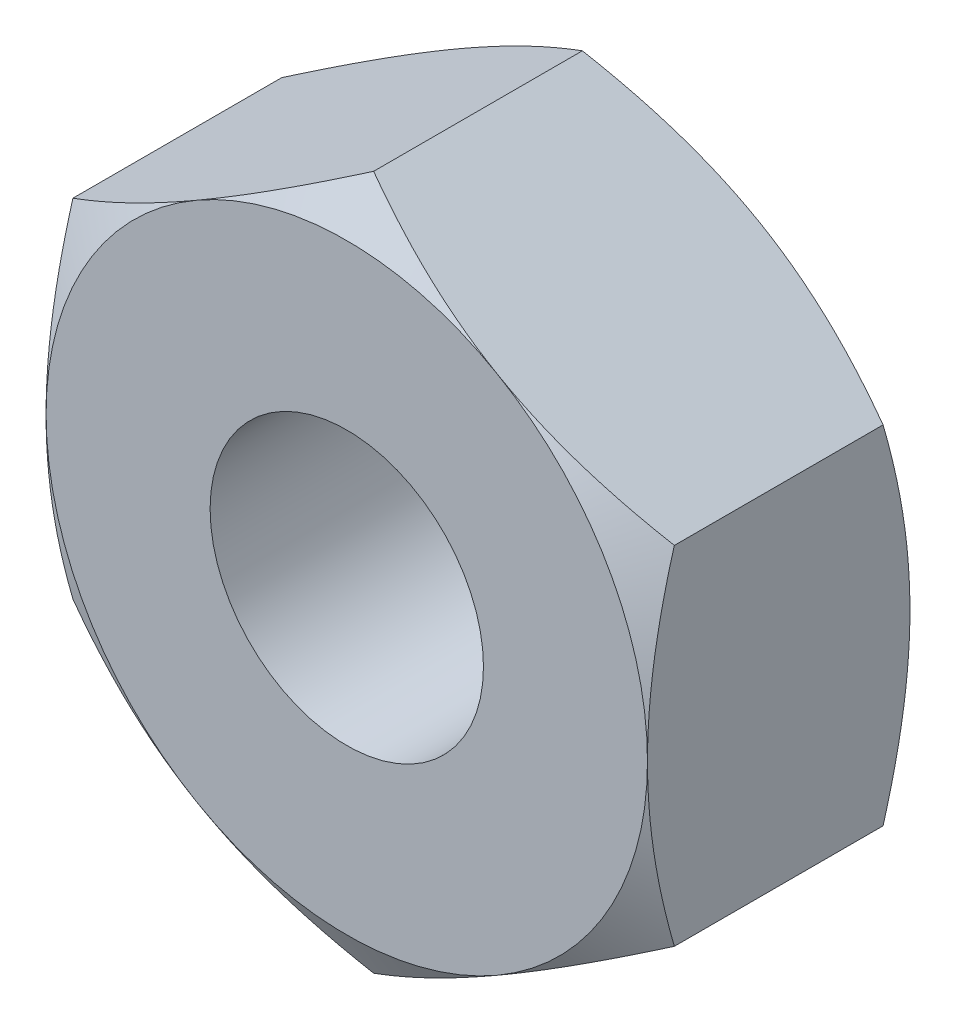
ISO-10303-21;
HEADER;
FILE_DESCRIPTION(('STEP AP214'),'2;1');
FILE_NAME('part.step','',(''),(''),'','','');
FILE_SCHEMA(('AUTOMOTIVE_DESIGN { 1 0 10303 214 1 1 1 1 }'));
ENDSEC;
DATA;
#1=APPLICATION_CONTEXT('core data for automotive mechanical design processes');
#2=APPLICATION_PROTOCOL_DEFINITION('international standard','automotive_design',2000,#1);
#3=PRODUCT_CONTEXT('',#1,'mechanical');
#4=PRODUCT('Part','Part','',(#3));
#5=PRODUCT_RELATED_PRODUCT_CATEGORY('part','',(#4));
#6=PRODUCT_DEFINITION_FORMATION('','',#4);
#7=PRODUCT_DEFINITION_CONTEXT('part definition',#1,'design');
#8=PRODUCT_DEFINITION('design','',#6,#7);
#9=PRODUCT_DEFINITION_SHAPE('','',#8);
#10=(LENGTH_UNIT() NAMED_UNIT(*) SI_UNIT(.MILLI.,.METRE.));
#11=(NAMED_UNIT(*) PLANE_ANGLE_UNIT() SI_UNIT($,.RADIAN.));
#12=(NAMED_UNIT(*) SI_UNIT($,.STERADIAN.) SOLID_ANGLE_UNIT());
#13=UNCERTAINTY_MEASURE_WITH_UNIT(LENGTH_MEASURE(1.E-05),#10,'distance_accuracy_value','');
#14=(GEOMETRIC_REPRESENTATION_CONTEXT(3) GLOBAL_UNCERTAINTY_ASSIGNED_CONTEXT((#13)) GLOBAL_UNIT_ASSIGNED_CONTEXT((#10,
#11,#12)) REPRESENTATION_CONTEXT('',''));
#15=CARTESIAN_POINT('',(0.,0.,0.));
#16=DIRECTION('',(0.,0.,1.));
#17=DIRECTION('',(1.,0.,0.));
#18=AXIS2_PLACEMENT_3D('',#15,#16,#17);
#19=CARTESIAN_POINT('',(0.,3.17542648054294,1.2));
#20=DIRECTION('',(0.5,-0.866025403784439,0.));
#21=DIRECTION('',(0.866025403784439,0.5,0.));
#22=AXIS2_PLACEMENT_3D('',#19,#20,#21);
#23=PLANE('',#22);
#24=CARTESIAN_POINT('',(0.000200000000000115,3.17554195059678,0.954313236635245));
#25=CARTESIAN_POINT('',(-0.120649220659906,3.10576962051743,0.994612337750741));
#26=CARTESIAN_POINT('',(-0.242541602622633,3.03539502097908,1.03126309740234));
#27=CARTESIAN_POINT('',(-0.488437126727892,2.89342717394439,1.0952378170302));
#28=CARTESIAN_POINT('',(-0.612444638573855,2.82183140359858,1.12253914432551));
#29=CARTESIAN_POINT('',(-0.858922797975943,2.67952717191842,1.16503825470589));
#30=CARTESIAN_POINT('',(-0.981355518587416,2.60884060771577,1.18051888137754));
#31=CARTESIAN_POINT('',(-1.22679714236891,2.46713482015519,1.19900060263006));
#32=CARTESIAN_POINT('',(-1.34980515323291,2.39611611197038,1.2020170005374));
#33=CARTESIAN_POINT('',(-1.57965878661079,2.26341005486544,1.19574685457145));
#34=CARTESIAN_POINT('',(-1.68653879125402,2.20170285541369,1.1879998457233));
#35=CARTESIAN_POINT('',(-1.89960246733475,2.07869048467395,1.16344481893565));
#36=CARTESIAN_POINT('',(-2.00578540164889,2.01738573896433,1.14662841034943));
#37=CARTESIAN_POINT('',(-2.21928848939318,1.89411967378235,1.10458807765405));
#38=CARTESIAN_POINT('',(-2.32658161614286,1.83217395817123,1.07918591931277));
#39=CARTESIAN_POINT('',(-2.53956747928405,1.70920651275308,1.02153277416002));
#40=CARTESIAN_POINT('',(-2.64526294502665,1.64818320715446,0.98929533670102));
#41=CARTESIAN_POINT('',(-2.7502,1.58759777021763,0.954313236635243));
#42=B_SPLINE_CURVE_WITH_KNOTS('',3,(#24,#25,#26,#27,#28,#29,#30,#31,#32,#33,#34,#35,#36,#37,#38,
#39,#40,#41),.UNSPECIFIED.,.F.,.F.,(4,2,2,2,2,2,2,2,4),(0.,0.435912828725888,0.872873557116331,
1.29901931904671,1.72464171213573,2.09526089052937,2.46622354066374,2.84541551798557,
3.22386274754524),.UNSPECIFIED.);
#43=CARTESIAN_POINT('',(0.,3.17542648054294,0.954379906938143));
#44=VERTEX_POINT('',#43);
#45=CARTESIAN_POINT('',(-1.375,2.38156986040721,1.2));
#46=VERTEX_POINT('',#45);
#47=EDGE_CURVE('E128',#44,#46,#42,.T.);
#48=ORIENTED_EDGE('',*,*,#47,.F.);
#49=DIRECTION('',(0.,0.,-1.));
#50=VECTOR('',#49,1.);
#51=CARTESIAN_POINT('',(0.,3.17542648054294,1.2));
#52=LINE('',#51,#50);
#53=CARTESIAN_POINT('',(0.,3.17542648054294,-0.954379906938143));
#54=VERTEX_POINT('',#53);
#55=EDGE_CURVE('E244',#44,#54,#52,.T.);
#56=ORIENTED_EDGE('',*,*,#55,.T.);
#57=CARTESIAN_POINT('',(-2.7502,1.58759777021763,-0.954313236635243));
#58=CARTESIAN_POINT('',(-2.6293507793401,1.65737010029699,-0.99461233775074));
#59=CARTESIAN_POINT('',(-2.50745839737737,1.72774469983533,-1.03126309740234));
#60=CARTESIAN_POINT('',(-2.26156287327211,1.86971254687003,-1.0952378170302));
#61=CARTESIAN_POINT('',(-2.13755536142615,1.94130831721583,-1.1225391443255));
#62=CARTESIAN_POINT('',(-1.89107720202406,2.08361254889599,-1.16503825470588));
#63=CARTESIAN_POINT('',(-1.76864448141259,2.15429911309864,-1.18051888137754));
#64=CARTESIAN_POINT('',(-1.52320285763109,2.29600490065923,-1.19900060263006));
#65=CARTESIAN_POINT('',(-1.40019484676709,2.36702360884404,-1.2020170005374));
#66=CARTESIAN_POINT('',(-1.17034121338921,2.49972966594897,-1.19574685457146));
#67=CARTESIAN_POINT('',(-1.06346120874598,2.56143686540072,-1.1879998457233));
#68=CARTESIAN_POINT('',(-0.850397532665252,2.68444923614046,-1.16344481893565));
#69=CARTESIAN_POINT('',(-0.744214598351113,2.74575398185008,-1.14662841034943));
#70=CARTESIAN_POINT('',(-0.530711510606817,2.86902004703206,-1.10458807765405));
#71=CARTESIAN_POINT('',(-0.423418383857146,2.93096576264318,-1.07918591931277));
#72=CARTESIAN_POINT('',(-0.210432520715949,3.05393320806134,-1.02153277416002));
#73=CARTESIAN_POINT('',(-0.104737054973348,3.11495651365995,-0.989295336701022));
#74=CARTESIAN_POINT('',(0.000199999999999903,3.17554195059678,-0.954313236635244));
#75=B_SPLINE_CURVE_WITH_KNOTS('',3,(#57,#58,#59,#60,#61,#62,#63,#64,#65,#66,#67,#68,#69,#70,#71,
#72,#73,#74),.UNSPECIFIED.,.F.,.F.,(4,2,2,2,2,2,2,2,4),(0.,0.435912828725888,0.872873557116332,
1.29901931904671,1.72464171213573,2.09526089052937,2.46622354066374,2.84541551798557,
3.22386274754524),.UNSPECIFIED.);
#76=CARTESIAN_POINT('',(-1.375,2.38156986040721,-1.2));
#77=VERTEX_POINT('',#76);
#78=EDGE_CURVE('E293',#77,#54,#75,.T.);
#79=ORIENTED_EDGE('',*,*,#78,.F.);
#80=CARTESIAN_POINT('',(-2.75,1.58771324027147,-0.954379906938141));
#81=VERTEX_POINT('',#80);
#82=EDGE_CURVE('E301',#81,#77,#75,.T.);
#83=ORIENTED_EDGE('',*,*,#82,.F.);
#84=DIRECTION('',(0.,0.,-1.));
#85=VECTOR('',#84,1.);
#86=CARTESIAN_POINT('',(-2.75,1.58771324027147,1.2));
#87=LINE('',#86,#85);
#88=CARTESIAN_POINT('',(-2.75,1.58771324027147,0.954379906938141));
#89=VERTEX_POINT('',#88);
#90=EDGE_CURVE('E153',#89,#81,#87,.T.);
#91=ORIENTED_EDGE('',*,*,#90,.F.);
#92=EDGE_CURVE('E138',#46,#89,#42,.T.);
#93=ORIENTED_EDGE('',*,*,#92,.F.);
#94=EDGE_LOOP('',(#48,#56,#79,#83,#91,#93));
#95=FACE_BOUND('',#94,.T.);
#96=ADVANCED_FACE('F39',(#95),#23,.F.);
#97=CARTESIAN_POINT('',(-2.75,1.58771324027147,1.2));
#98=DIRECTION('',(1.,0.,0.));
#99=DIRECTION('',(0.,0.,-1.));
#100=AXIS2_PLACEMENT_3D('',#97,#98,#99);
#101=PLANE('',#100);
#102=CARTESIAN_POINT('',(-2.75,-4.30390301720216,-0.161076408690825));
#103=CARTESIAN_POINT('',(-2.75,-4.1834618363452,-0.102495462412647));
#104=CARTESIAN_POINT('',(-2.75,-4.06274834693833,-0.0444649946514505));
#105=CARTESIAN_POINT('',(-2.75,-3.82063209362876,0.0701861633603225));
#106=CARTESIAN_POINT('',(-2.75,-3.69922922817271,0.12680663891875));
#107=CARTESIAN_POINT('',(-2.75,-3.45498258352454,0.238605553593622));
#108=CARTESIAN_POINT('',(-2.75,-3.33213458050114,0.293774796098197));
#109=CARTESIAN_POINT('',(-2.75,-3.08547511508713,0.401907353546489));
#110=CARTESIAN_POINT('',(-2.75,-2.96166369739842,0.454870770123445));
#111=CARTESIAN_POINT('',(-2.75,-2.70873002170823,0.559731360531962));
#112=CARTESIAN_POINT('',(-2.75,-2.57956837503774,0.611534033727797));
#113=CARTESIAN_POINT('',(-2.75,-2.31974843728982,0.711312632694167));
#114=CARTESIAN_POINT('',(-2.75,-2.18908998221549,0.759288134467299));
#115=CARTESIAN_POINT('',(-2.75,-1.92630078982468,0.850181497874806));
#116=CARTESIAN_POINT('',(-2.75,-1.79417351465793,0.893109270571249));
#117=CARTESIAN_POINT('',(-2.75,-1.52802381114183,0.972555534531204));
#118=CARTESIAN_POINT('',(-2.75,-1.39400198148737,1.00907600370373));
#119=CARTESIAN_POINT('',(-2.75,-1.12474260519898,1.07378343729291));
#120=CARTESIAN_POINT('',(-2.75,-0.989516518476871,1.10201722216619));
#121=CARTESIAN_POINT('',(-2.75,-0.717342133540319,1.14858513052452));
#122=CARTESIAN_POINT('',(-2.75,-0.580394010715088,1.16692025396292));
#123=CARTESIAN_POINT('',(-2.75,-0.307264223292279,1.19198982834035));
#124=CARTESIAN_POINT('',(-2.75,-0.171096876658462,1.19887642876326));
#125=CARTESIAN_POINT('',(-2.75,0.101336625312924,1.20086815686916));
#126=CARTESIAN_POINT('',(-2.75,0.237602781705802,1.19597315681278));
#127=CARTESIAN_POINT('',(-2.75,0.46779768056081,1.17810232782277));
#128=CARTESIAN_POINT('',(-2.75,0.56196791548098,1.16804522235862));
#129=CARTESIAN_POINT('',(-2.75,0.74964222683461,1.14290982744913));
#130=CARTESIAN_POINT('',(-2.75,0.843146215373602,1.12783088758259));
#131=CARTESIAN_POINT('',(-2.75,1.12250913895,1.07584910895221));
#132=CARTESIAN_POINT('',(-2.75,1.30711940645784,1.03221009052056));
#133=CARTESIAN_POINT('',(-2.75,1.67667658210247,0.930598702582575));
#134=CARTESIAN_POINT('',(-2.75,1.86153763251195,0.87232596653373));
#135=CARTESIAN_POINT('',(-2.75,2.13625516693807,0.777677043706168));
#136=CARTESIAN_POINT('',(-2.75,2.22739058019847,0.744924041754434));
#137=CARTESIAN_POINT('',(-2.75,2.4089035897785,0.677382180856421));
#138=CARTESIAN_POINT('',(-2.75,2.4992811965008,0.642593349909108));
#139=CARTESIAN_POINT('',(-2.75,2.71825345258541,0.555929422896265));
#140=CARTESIAN_POINT('',(-2.75,2.84649489461476,0.503164300130324));
#141=CARTESIAN_POINT('',(-2.75,3.10183054994608,0.394920499569379));
#142=CARTESIAN_POINT('',(-2.75,3.22892468521508,0.339441638824839));
#143=CARTESIAN_POINT('',(-2.75,3.60884508520039,0.169807317208292));
#144=CARTESIAN_POINT('',(-2.75,3.8602516138296,0.0524776136912291));
#145=CARTESIAN_POINT('',(-2.75,4.36073216273548,-0.187701259786182));
#146=CARTESIAN_POINT('',(-2.75,4.6098032281523,-0.310556513491418));
#147=CARTESIAN_POINT('',(-2.75,5.1061163633384,-0.559922515280692));
#148=CARTESIAN_POINT('',(-2.75,5.35335836018185,-0.68643340814069));
#149=CARTESIAN_POINT('',(-2.75,5.82470677893945,-0.930706625425081));
#150=CARTESIAN_POINT('',(-2.75,6.04892545541805,-1.04825313857292));
#151=CARTESIAN_POINT('',(-2.75,6.49653363605935,-1.28493475206167));
#152=CARTESIAN_POINT('',(-2.75,6.71992310596419,-1.40406991712259));
#153=CARTESIAN_POINT('',(-2.75,7.16544823954543,-1.64321658337446));
#154=CARTESIAN_POINT('',(-2.75,7.38758566096619,-1.76322481484966));
#155=CARTESIAN_POINT('',(-2.75,7.8313334660235,-2.00418017005897));
#156=CARTESIAN_POINT('',(-2.75,8.0529438808444,-2.12512723633799));
#157=CARTESIAN_POINT('',(-2.75,8.27436218409947,-2.2464225529458));
#158=B_SPLINE_CURVE_WITH_KNOTS('',3,(#102,#103,#104,#105,#106,#107,#108,#109,#110,#111,#112,
#113,#114,#115,#116,#117,#118,#119,#120,#121,#122,#123,#124,#125,#126,#127,#128,#129,#130,#131,
#132,#133,#134,#135,#136,#137,#138,#139,#140,#141,#142,#143,#144,#145,#146,#147,#148,#149,#150,
#151,#152,#153,#154,#155,#156,#157),.UNSPECIFIED.,.F.,.F.,(4,2,2,2,2,2,2,2,2,2,2,2,2,2,2,2,2,2,
2,2,2,2,2,2,2,2,2,4),(0.,0.401800999438941,0.803662809496805,1.20764727157332,1.61161309946234,
2.0290542035636,2.44654149029701,2.8631948591784,3.27971938165083,3.69384308413973,
4.10792494441568,4.51645837884842,4.92499624273406,5.20897756068266,5.49299567382171,
6.06133052851019,6.64245100592875,6.93295892589164,7.22346285140748,7.63943779361217,
8.05544081796505,8.8876337420945,9.72076650036479,10.553932298919,11.3134121306103,
12.0729229978169,12.8303656683844,13.5877623445884),.UNSPECIFIED.);
#159=CARTESIAN_POINT('',(-2.75,0.,1.2));
#160=VERTEX_POINT('',#159);
#161=EDGE_CURVE('E144',#89,#160,#158,.F.);
#162=ORIENTED_EDGE('',*,*,#161,.F.);
#163=ORIENTED_EDGE('',*,*,#90,.T.);
#164=CARTESIAN_POINT('',(-2.75,-4.30390301720192,0.161076408690709));
#165=CARTESIAN_POINT('',(-2.75,-4.18346183634496,0.102495462412532));
#166=CARTESIAN_POINT('',(-2.75,-4.0627483469381,0.0444649946513373));
#167=CARTESIAN_POINT('',(-2.75,-3.82063209362853,-0.0701861633604315));
#168=CARTESIAN_POINT('',(-2.75,-3.69922922817248,-0.126806638918857));
#169=CARTESIAN_POINT('',(-2.75,-3.45498258352431,-0.238605553593725));
#170=CARTESIAN_POINT('',(-2.75,-3.33213458050091,-0.293774796098297));
#171=CARTESIAN_POINT('',(-2.75,-3.08547511508691,-0.401907353546585));
#172=CARTESIAN_POINT('',(-2.75,-2.9616636973982,-0.454870770123538));
#173=CARTESIAN_POINT('',(-2.75,-2.70873002170802,-0.559731360532049));
#174=CARTESIAN_POINT('',(-2.75,-2.57956837503753,-0.611534033727881));
#175=CARTESIAN_POINT('',(-2.75,-2.31974843728962,-0.711312632694245));
#176=CARTESIAN_POINT('',(-2.75,-2.18908998221528,-0.759288134467373));
#177=CARTESIAN_POINT('',(-2.75,-1.92630078982448,-0.850181497874872));
#178=CARTESIAN_POINT('',(-2.75,-1.79417351465773,-0.893109270571312));
#179=CARTESIAN_POINT('',(-2.75,-1.52802381114163,-0.972555534531259));
#180=CARTESIAN_POINT('',(-2.75,-1.39400198148718,-1.00907600370378));
#181=CARTESIAN_POINT('',(-2.75,-1.1247426051988,-1.07378343729295));
#182=CARTESIAN_POINT('',(-2.75,-0.98951651847669,-1.10201722216622));
#183=CARTESIAN_POINT('',(-2.75,-0.717342133540144,-1.14858513052455));
#184=CARTESIAN_POINT('',(-2.75,-0.580394010714915,-1.16692025396294));
#185=CARTESIAN_POINT('',(-2.75,-0.307264223292112,-1.19198982834036));
#186=CARTESIAN_POINT('',(-2.75,-0.171096876658298,-1.19887642876326));
#187=CARTESIAN_POINT('',(-2.75,0.101336625313081,-1.20086815686916));
#188=CARTESIAN_POINT('',(-2.75,0.237602781705956,-1.19597315681277));
#189=CARTESIAN_POINT('',(-2.75,0.467797680560964,-1.17810232782276));
#190=CARTESIAN_POINT('',(-2.75,0.561967915481139,-1.1680452223586));
#191=CARTESIAN_POINT('',(-2.75,0.749642226834777,-1.14290982744911));
#192=CARTESIAN_POINT('',(-2.75,0.843146215373774,-1.12783088758256));
#193=CARTESIAN_POINT('',(-2.75,1.12250913895018,-1.07584910895217));
#194=CARTESIAN_POINT('',(-2.75,1.30711940645803,-1.03221009052051));
#195=CARTESIAN_POINT('',(-2.75,1.67667658210268,-0.930598702582513));
#196=CARTESIAN_POINT('',(-2.75,1.86153763251216,-0.87232596653366));
#197=CARTESIAN_POINT('',(-2.75,2.1362551669383,-0.777677043706087));
#198=CARTESIAN_POINT('',(-2.75,2.2273905801987,-0.74492404175435));
#199=CARTESIAN_POINT('',(-2.75,2.40890358977874,-0.677382180856329));
#200=CARTESIAN_POINT('',(-2.75,2.49928119650105,-0.642593349909013));
#201=CARTESIAN_POINT('',(-2.75,2.71825345258565,-0.555929422896168));
#202=CARTESIAN_POINT('',(-2.75,2.84649489461499,-0.503164300130228));
#203=CARTESIAN_POINT('',(-2.75,3.1018305499463,-0.394920499569286));
#204=CARTESIAN_POINT('',(-2.75,3.22892468521528,-0.33944163882475));
#205=CARTESIAN_POINT('',(-2.75,3.60884508520057,-0.16980731720821));
#206=CARTESIAN_POINT('',(-2.75,3.86025161382976,-0.0524776136911526));
#207=CARTESIAN_POINT('',(-2.75,4.36073216273561,0.187701259786246));
#208=CARTESIAN_POINT('',(-2.75,4.60980322815241,0.310556513491473));
#209=CARTESIAN_POINT('',(-2.75,5.10611636333848,0.559922515280733));
#210=CARTESIAN_POINT('',(-2.75,5.35335836018192,0.686433408140724));
#211=CARTESIAN_POINT('',(-2.75,5.82470677893949,0.930706625425102));
#212=CARTESIAN_POINT('',(-2.75,6.04892545541808,1.04825313857293));
#213=CARTESIAN_POINT('',(-2.75,6.49653363605935,1.28493475206167));
#214=CARTESIAN_POINT('',(-2.75,6.71992310596418,1.40406991712259));
#215=CARTESIAN_POINT('',(-2.75,7.1654482395454,1.64321658337444));
#216=CARTESIAN_POINT('',(-2.75,7.38758566096615,1.76322481484964));
#217=CARTESIAN_POINT('',(-2.75,7.83133346602344,2.00418017005894));
#218=CARTESIAN_POINT('',(-2.75,8.05294388084433,2.12512723633796));
#219=CARTESIAN_POINT('',(-2.75,8.27436218409939,2.24642255294576));
#220=B_SPLINE_CURVE_WITH_KNOTS('',3,(#164,#165,#166,#167,#168,#169,#170,#171,#172,#173,#174,
#175,#176,#177,#178,#179,#180,#181,#182,#183,#184,#185,#186,#187,#188,#189,#190,#191,#192,#193,
#194,#195,#196,#197,#198,#199,#200,#201,#202,#203,#204,#205,#206,#207,#208,#209,#210,#211,#212,
#213,#214,#215,#216,#217,#218,#219),.UNSPECIFIED.,.F.,.F.,(4,2,2,2,2,2,2,2,2,2,2,2,2,2,2,2,2,2,
2,2,2,2,2,2,2,2,2,4),(0.,0.401800999438933,0.803662809496789,1.2076472715733,1.61161309946231,
2.02905420356356,2.44654149029695,2.86319485917833,3.27971938165075,3.69384308413964,
4.10792494441558,4.51645837884831,4.92499624273394,5.20897756068255,5.49299567382162,
6.06133052851013,6.64245100592872,6.93295892589162,7.22346285140748,7.63943779361214,
8.055440817965,8.88763374209439,9.72076650036463,10.5539322989188,11.31341213061,
12.0729229978166,12.8303656683841,13.5877623445881),.UNSPECIFIED.);
#221=CARTESIAN_POINT('',(-2.75,0.,-1.2));
#222=VERTEX_POINT('',#221);
#223=EDGE_CURVE('E234',#222,#81,#220,.T.);
#224=ORIENTED_EDGE('',*,*,#223,.F.);
#225=CARTESIAN_POINT('',(-2.75,-1.58771324027169,-0.954379906938282));
#226=VERTEX_POINT('',#225);
#227=EDGE_CURVE('E316',#226,#222,#220,.T.);
#228=ORIENTED_EDGE('',*,*,#227,.F.);
#229=DIRECTION('',(0.,0.,-1.));
#230=VECTOR('',#229,1.);
#231=CARTESIAN_POINT('',(-2.75,-1.58771324027147,1.2));
#232=LINE('',#231,#230);
#233=CARTESIAN_POINT('',(-2.75,-1.58771324027147,0.95437990693814));
#234=VERTEX_POINT('',#233);
#235=EDGE_CURVE('E260',#234,#226,#232,.T.);
#236=ORIENTED_EDGE('',*,*,#235,.F.);
#237=EDGE_CURVE('E156',#160,#234,#158,.F.);
#238=ORIENTED_EDGE('',*,*,#237,.F.);
#239=EDGE_LOOP('',(#162,#163,#224,#228,#236,#238));
#240=FACE_BOUND('',#239,.T.);
#241=ADVANCED_FACE('F217',(#240),#101,.F.);
#242=CARTESIAN_POINT('',(-2.75,-1.58771324027147,1.2));
#243=DIRECTION('',(0.5,0.866025403784438,0.));
#244=DIRECTION('',(-0.866025403784439,0.5,0.));
#245=AXIS2_PLACEMENT_3D('',#242,#243,#244);
#246=PLANE('',#245);
#247=CARTESIAN_POINT('',(-2.7502,-1.58759777021764,0.954313236635242));
#248=CARTESIAN_POINT('',(-2.6293507793401,-1.65737010029699,0.994612337750739));
#249=CARTESIAN_POINT('',(-2.50745839737737,-1.72774469983533,1.03126309740234));
#250=CARTESIAN_POINT('',(-2.26156287327211,-1.86971254687003,1.0952378170302));
#251=CARTESIAN_POINT('',(-2.13755536142615,-1.94130831721583,1.1225391443255));
#252=CARTESIAN_POINT('',(-1.89107720202406,-2.08361254889599,1.16503825470588));
#253=CARTESIAN_POINT('',(-1.76864448141259,-2.15429911309864,1.18051888137754));
#254=CARTESIAN_POINT('',(-1.52320285763109,-2.29600490065923,1.19900060263006));
#255=CARTESIAN_POINT('',(-1.40019484676709,-2.36702360884404,1.2020170005374));
#256=CARTESIAN_POINT('',(-1.17034121338921,-2.49972966594897,1.19574685457145));
#257=CARTESIAN_POINT('',(-1.06346120874598,-2.56143686540073,1.1879998457233));
#258=CARTESIAN_POINT('',(-0.850397532665252,-2.68444923614047,1.16344481893564));
#259=CARTESIAN_POINT('',(-0.744214598351113,-2.74575398185008,1.14662841034943));
#260=CARTESIAN_POINT('',(-0.530711510606818,-2.86902004703207,1.10458807765404));
#261=CARTESIAN_POINT('',(-0.423418383857146,-2.93096576264319,1.07918591931277));
#262=CARTESIAN_POINT('',(-0.210432520715949,-3.05393320806134,1.02153277416002));
#263=CARTESIAN_POINT('',(-0.104737054973348,-3.11495651365996,0.989295336701018));
#264=CARTESIAN_POINT('',(0.000200000000000066,-3.17554195059679,0.954313236635241));
#265=B_SPLINE_CURVE_WITH_KNOTS('',3,(#247,#248,#249,#250,#251,#252,#253,#254,#255,#256,#257,
#258,#259,#260,#261,#262,#263,#264),.UNSPECIFIED.,.F.,.F.,(4,2,2,2,2,2,2,2,4),(0.,
0.435912828725888,0.872873557116332,1.29901931904672,1.72464171213574,2.09526089052938,
2.46622354066374,2.84541551798557,3.22386274754525),.UNSPECIFIED.);
#266=CARTESIAN_POINT('',(-1.375,-2.38156986040721,1.2));
#267=VERTEX_POINT('',#266);
#268=EDGE_CURVE('E211',#234,#267,#265,.T.);
#269=ORIENTED_EDGE('',*,*,#268,.F.);
#270=ORIENTED_EDGE('',*,*,#235,.T.);
#271=CARTESIAN_POINT('',(0.000199999999999867,-3.17554195059679,-0.954313236635241));
#272=CARTESIAN_POINT('',(-0.120649220659906,-3.10576962051743,-0.994612337750738));
#273=CARTESIAN_POINT('',(-0.242541602622634,-3.03539502097909,-1.03126309740234));
#274=CARTESIAN_POINT('',(-0.488437126727893,-2.89342717394439,-1.0952378170302));
#275=CARTESIAN_POINT('',(-0.612444638573856,-2.82183140359859,-1.1225391443255));
#276=CARTESIAN_POINT('',(-0.858922797975945,-2.67952717191843,-1.16503825470588));
#277=CARTESIAN_POINT('',(-0.981355518587418,-2.60884060771578,-1.18051888137754));
#278=CARTESIAN_POINT('',(-1.22679714236892,-2.46713482015519,-1.19900060263006));
#279=CARTESIAN_POINT('',(-1.34980515323291,-2.39611611197038,-1.2020170005374));
#280=CARTESIAN_POINT('',(-1.57965878661079,-2.26341005486545,-1.19574685457145));
#281=CARTESIAN_POINT('',(-1.68653879125402,-2.20170285541369,-1.1879998457233));
#282=CARTESIAN_POINT('',(-1.89960246733475,-2.07869048467395,-1.16344481893564));
#283=CARTESIAN_POINT('',(-2.00578540164889,-2.01738573896434,-1.14662841034943));
#284=CARTESIAN_POINT('',(-2.21928848939319,-1.89411967378235,-1.10458807765404));
#285=CARTESIAN_POINT('',(-2.32658161614286,-1.83217395817123,-1.07918591931277));
#286=CARTESIAN_POINT('',(-2.53956747928405,-1.70920651275308,-1.02153277416002));
#287=CARTESIAN_POINT('',(-2.64526294502665,-1.64818320715446,-0.989295336701019));
#288=CARTESIAN_POINT('',(-2.7502,-1.58759777021764,-0.954313236635242));
#289=B_SPLINE_CURVE_WITH_KNOTS('',3,(#271,#272,#273,#274,#275,#276,#277,#278,#279,#280,#281,
#282,#283,#284,#285,#286,#287,#288),.UNSPECIFIED.,.F.,.F.,(4,2,2,2,2,2,2,2,4),(0.,
0.435912828725888,0.872873557116332,1.29901931904672,1.72464171213574,2.09526089052938,
2.46622354066374,2.84541551798557,3.22386274754525),.UNSPECIFIED.);
#290=CARTESIAN_POINT('',(-1.375,-2.38156986040721,-1.2));
#291=VERTEX_POINT('',#290);
#292=EDGE_CURVE('E223',#291,#226,#289,.T.);
#293=ORIENTED_EDGE('',*,*,#292,.F.);
#294=CARTESIAN_POINT('',(0.,-3.17542648054295,-0.954379906938139));
#295=VERTEX_POINT('',#294);
#296=EDGE_CURVE('E232',#295,#291,#289,.T.);
#297=ORIENTED_EDGE('',*,*,#296,.F.);
#298=DIRECTION('',(0.,0.,-1.));
#299=VECTOR('',#298,1.);
#300=CARTESIAN_POINT('',(0.,-3.17542648054295,1.2));
#301=LINE('',#300,#299);
#302=CARTESIAN_POINT('',(0.,-3.17542648054295,0.954379906938139));
#303=VERTEX_POINT('',#302);
#304=EDGE_CURVE('E257',#303,#295,#301,.T.);
#305=ORIENTED_EDGE('',*,*,#304,.F.);
#306=EDGE_CURVE('E204',#267,#303,#265,.T.);
#307=ORIENTED_EDGE('',*,*,#306,.F.);
#308=EDGE_LOOP('',(#269,#270,#293,#297,#305,#307));
#309=FACE_BOUND('',#308,.T.);
#310=ADVANCED_FACE('F213',(#309),#246,.F.);
#311=CARTESIAN_POINT('',(0.,-3.17542648054295,1.2));
#312=DIRECTION('',(-0.500000000000001,0.866025403784438,0.));
#313=DIRECTION('',(-0.866025403784438,-0.500000000000001,0.));
#314=AXIS2_PLACEMENT_3D('',#311,#312,#313);
#315=PLANE('',#314);
#316=CARTESIAN_POINT('',(-0.000200000000000038,-3.17554195059679,0.954313236635241));
#317=CARTESIAN_POINT('',(0.120649220659906,-3.10576962051743,0.994612337750738));
#318=CARTESIAN_POINT('',(0.242541602622634,-3.03539502097909,1.03126309740234));
#319=CARTESIAN_POINT('',(0.488437126727893,-2.89342717394439,1.0952378170302));
#320=CARTESIAN_POINT('',(0.612444638573855,-2.82183140359859,1.1225391443255));
#321=CARTESIAN_POINT('',(0.858922797975944,-2.67952717191843,1.16503825470588));
#322=CARTESIAN_POINT('',(0.981355518587417,-2.60884060771578,1.18051888137754));
#323=CARTESIAN_POINT('',(1.22679714236892,-2.46713482015519,1.19900060263006));
#324=CARTESIAN_POINT('',(1.34980515323291,-2.39611611197038,1.2020170005374));
#325=CARTESIAN_POINT('',(1.57965878661079,-2.26341005486545,1.19574685457145));
#326=CARTESIAN_POINT('',(1.68653879125402,-2.20170285541369,1.1879998457233));
#327=CARTESIAN_POINT('',(1.89960246733475,-2.07869048467395,1.16344481893565));
#328=CARTESIAN_POINT('',(2.00578540164889,-2.01738573896434,1.14662841034943));
#329=CARTESIAN_POINT('',(2.21928848939318,-1.89411967378235,1.10458807765405));
#330=CARTESIAN_POINT('',(2.32658161614285,-1.83217395817123,1.07918591931277));
#331=CARTESIAN_POINT('',(2.53956747928405,-1.70920651275308,1.02153277416002));
#332=CARTESIAN_POINT('',(2.64526294502665,-1.64818320715447,0.989295336701021));
#333=CARTESIAN_POINT('',(2.7502,-1.58759777021764,0.954313236635244));
#334=B_SPLINE_CURVE_WITH_KNOTS('',3,(#316,#317,#318,#319,#320,#321,#322,#323,#324,#325,#326,
#327,#328,#329,#330,#331,#332,#333),.UNSPECIFIED.,.F.,.F.,(4,2,2,2,2,2,2,2,4),(0.,
0.435912828725888,0.872873557116332,1.29901931904672,1.72464171213574,2.09526089052938,
2.46622354066374,2.84541551798557,3.22386274754524),.UNSPECIFIED.);
#335=CARTESIAN_POINT('',(1.375,-2.38156986040721,1.2));
#336=VERTEX_POINT('',#335);
#337=EDGE_CURVE('E212',#303,#336,#334,.T.);
#338=ORIENTED_EDGE('',*,*,#337,.F.);
#339=ORIENTED_EDGE('',*,*,#304,.T.);
#340=CARTESIAN_POINT('',(2.7502,-1.58759777021764,-0.954313236635244));
#341=CARTESIAN_POINT('',(2.62935077934009,-1.65737010029699,-0.994612337750741));
#342=CARTESIAN_POINT('',(2.50745839737737,-1.72774469983533,-1.03126309740234));
#343=CARTESIAN_POINT('',(2.26156287327211,-1.86971254687003,-1.0952378170302));
#344=CARTESIAN_POINT('',(2.13755536142614,-1.94130831721583,-1.1225391443255));
#345=CARTESIAN_POINT('',(1.89107720202406,-2.08361254889599,-1.16503825470588));
#346=CARTESIAN_POINT('',(1.76864448141258,-2.15429911309864,-1.18051888137754));
#347=CARTESIAN_POINT('',(1.52320285763108,-2.29600490065923,-1.19900060263006));
#348=CARTESIAN_POINT('',(1.40019484676709,-2.36702360884404,-1.2020170005374));
#349=CARTESIAN_POINT('',(1.17034121338921,-2.49972966594897,-1.19574685457145));
#350=CARTESIAN_POINT('',(1.06346120874598,-2.56143686540073,-1.1879998457233));
#351=CARTESIAN_POINT('',(0.85039753266525,-2.68444923614047,-1.16344481893564));
#352=CARTESIAN_POINT('',(0.744214598351111,-2.74575398185008,-1.14662841034943));
#353=CARTESIAN_POINT('',(0.530711510606816,-2.86902004703207,-1.10458807765404));
#354=CARTESIAN_POINT('',(0.423418383857145,-2.93096576264319,-1.07918591931277));
#355=CARTESIAN_POINT('',(0.210432520715949,-3.05393320806134,-1.02153277416002));
#356=CARTESIAN_POINT('',(0.104737054973347,-3.11495651365996,-0.989295336701018));
#357=CARTESIAN_POINT('',(-0.000200000000000245,-3.17554195059679,-0.95431323663524));
#358=B_SPLINE_CURVE_WITH_KNOTS('',3,(#340,#341,#342,#343,#344,#345,#346,#347,#348,#349,#350,
#351,#352,#353,#354,#355,#356,#357),.UNSPECIFIED.,.F.,.F.,(4,2,2,2,2,2,2,2,4),(0.,
0.435912828725888,0.872873557116331,1.29901931904671,1.72464171213573,2.09526089052937,
2.46622354066374,2.84541551798557,3.22386274754524),.UNSPECIFIED.);
#359=CARTESIAN_POINT('',(1.375,-2.38156986040721,-1.2));
#360=VERTEX_POINT('',#359);
#361=EDGE_CURVE('E233',#360,#295,#358,.T.);
#362=ORIENTED_EDGE('',*,*,#361,.F.);
#363=CARTESIAN_POINT('',(2.75,-1.58771324027169,-0.954379906938284));
#364=VERTEX_POINT('',#363);
#365=EDGE_CURVE('E302',#364,#360,#358,.T.);
#366=ORIENTED_EDGE('',*,*,#365,.F.);
#367=DIRECTION('',(0.,0.,-1.));
#368=VECTOR('',#367,1.);
#369=CARTESIAN_POINT('',(2.75,-1.58771324027147,1.2));
#370=LINE('',#369,#368);
#371=CARTESIAN_POINT('',(2.75,-1.58771324027169,0.954379906938284));
#372=VERTEX_POINT('',#371);
#373=EDGE_CURVE('E254',#372,#364,#370,.T.);
#374=ORIENTED_EDGE('',*,*,#373,.F.);
#375=EDGE_CURVE('E198',#336,#372,#334,.T.);
#376=ORIENTED_EDGE('',*,*,#375,.F.);
#377=EDGE_LOOP('',(#338,#339,#362,#366,#374,#376));
#378=FACE_BOUND('',#377,.T.);
#379=ADVANCED_FACE('F216',(#378),#315,.F.);
#380=CARTESIAN_POINT('',(2.75,1.58771324027147,1.2));
#381=DIRECTION('',(-1.,0.,0.));
#382=DIRECTION('',(0.,0.,1.));
#383=AXIS2_PLACEMENT_3D('',#380,#381,#382);
#384=PLANE('',#383);
#385=CARTESIAN_POINT('',(2.75,-4.30390301720216,-0.161076408690823));
#386=CARTESIAN_POINT('',(2.75,-4.1834618363452,-0.102495462412644));
#387=CARTESIAN_POINT('',(2.75,-4.06274834693833,-0.0444649946514476));
#388=CARTESIAN_POINT('',(2.75,-3.82063209362876,0.0701861633603253));
#389=CARTESIAN_POINT('',(2.75,-3.69922922817271,0.126806638918753));
#390=CARTESIAN_POINT('',(2.75,-3.45498258352453,0.238605553593625));
#391=CARTESIAN_POINT('',(2.75,-3.33213458050114,0.293774796098199));
#392=CARTESIAN_POINT('',(2.75,-3.08547511508713,0.401907353546491));
#393=CARTESIAN_POINT('',(2.75,-2.96166369739842,0.454870770123447));
#394=CARTESIAN_POINT('',(2.75,-2.70873002170823,0.559731360531964));
#395=CARTESIAN_POINT('',(2.75,-2.57956837503774,0.611534033727799));
#396=CARTESIAN_POINT('',(2.75,-2.31974843728982,0.711312632694169));
#397=CARTESIAN_POINT('',(2.75,-2.18908998221549,0.759288134467301));
#398=CARTESIAN_POINT('',(2.75,-1.92630078982468,0.850181497874809));
#399=CARTESIAN_POINT('',(2.75,-1.79417351465793,0.893109270571251));
#400=CARTESIAN_POINT('',(2.75,-1.52802381114183,0.972555534531206));
#401=CARTESIAN_POINT('',(2.75,-1.39400198148737,1.00907600370374));
#402=CARTESIAN_POINT('',(2.75,-1.12474260519898,1.07378343729291));
#403=CARTESIAN_POINT('',(2.75,-0.989516518476872,1.10201722216619));
#404=CARTESIAN_POINT('',(2.75,-0.71734213354032,1.14858513052452));
#405=CARTESIAN_POINT('',(2.75,-0.580394010715089,1.16692025396292));
#406=CARTESIAN_POINT('',(2.75,-0.30726422329228,1.19198982834035));
#407=CARTESIAN_POINT('',(2.75,-0.171096876658463,1.19887642876326));
#408=CARTESIAN_POINT('',(2.75,0.101336625312923,1.20086815686917));
#409=CARTESIAN_POINT('',(2.75,0.237602781705801,1.19597315681278));
#410=CARTESIAN_POINT('',(2.75,0.467797680560807,1.17810232782278));
#411=CARTESIAN_POINT('',(2.75,0.561967915480977,1.16804522235862));
#412=CARTESIAN_POINT('',(2.75,0.749642226834607,1.14290982744913));
#413=CARTESIAN_POINT('',(2.75,0.843146215373599,1.12783088758259));
#414=CARTESIAN_POINT('',(2.75,1.12250913895,1.07584910895221));
#415=CARTESIAN_POINT('',(2.75,1.30711940645783,1.03221009052056));
#416=CARTESIAN_POINT('',(2.75,1.67667658210247,0.930598702582579));
#417=CARTESIAN_POINT('',(2.75,1.86153763251194,0.872325966533733));
#418=CARTESIAN_POINT('',(2.75,2.13625516693807,0.777677043706171));
#419=CARTESIAN_POINT('',(2.75,2.22739058019846,0.744924041754438));
#420=CARTESIAN_POINT('',(2.75,2.4089035897785,0.677382180856425));
#421=CARTESIAN_POINT('',(2.75,2.4992811965008,0.642593349909112));
#422=CARTESIAN_POINT('',(2.75,2.71825345258541,0.555929422896269));
#423=CARTESIAN_POINT('',(2.75,2.84649489461475,0.503164300130328));
#424=CARTESIAN_POINT('',(2.75,3.10183054994608,0.394920499569382));
#425=CARTESIAN_POINT('',(2.75,3.22892468521507,0.339441638824843));
#426=CARTESIAN_POINT('',(2.75,3.60884508520039,0.169807317208296));
#427=CARTESIAN_POINT('',(2.75,3.86025161382959,0.0524776136912324));
#428=CARTESIAN_POINT('',(2.75,4.36073216273547,-0.187701259786179));
#429=CARTESIAN_POINT('',(2.75,4.6098032281523,-0.310556513491414));
#430=CARTESIAN_POINT('',(2.75,5.1061163633384,-0.559922515280689));
#431=CARTESIAN_POINT('',(2.75,5.35335836018185,-0.686433408140688));
#432=CARTESIAN_POINT('',(2.75,5.82470677893945,-0.930706625425079));
#433=CARTESIAN_POINT('',(2.75,6.04892545541805,-1.04825313857292));
#434=CARTESIAN_POINT('',(2.75,6.49653363605935,-1.28493475206166));
#435=CARTESIAN_POINT('',(2.75,6.71992310596419,-1.40406991712259));
#436=CARTESIAN_POINT('',(2.75,7.16544823954543,-1.64321658337445));
#437=CARTESIAN_POINT('',(2.75,7.38758566096619,-1.76322481484966));
#438=CARTESIAN_POINT('',(2.75,7.8313334660235,-2.00418017005897));
#439=CARTESIAN_POINT('',(2.75,8.0529438808444,-2.12512723633799));
#440=CARTESIAN_POINT('',(2.75,8.27436218409946,-2.2464225529458));
#441=B_SPLINE_CURVE_WITH_KNOTS('',3,(#385,#386,#387,#388,#389,#390,#391,#392,#393,#394,#395,
#396,#397,#398,#399,#400,#401,#402,#403,#404,#405,#406,#407,#408,#409,#410,#411,#412,#413,#414,
#415,#416,#417,#418,#419,#420,#421,#422,#423,#424,#425,#426,#427,#428,#429,#430,#431,#432,#433,
#434,#435,#436,#437,#438,#439,#440),.UNSPECIFIED.,.F.,.F.,(4,2,2,2,2,2,2,2,2,2,2,2,2,2,2,2,2,2,
2,2,2,2,2,2,2,2,2,4),(0.,0.401800999438941,0.803662809496804,1.20764727157332,1.61161309946234,
2.0290542035636,2.44654149029701,2.8631948591784,3.27971938165083,3.69384308413973,
4.10792494441568,4.51645837884842,4.92499624273405,5.20897756068265,5.4929956738217,
6.06133052851018,6.64245100592874,6.93295892589163,7.22346285140747,7.63943779361216,
8.05544081796504,8.88763374209449,9.72076650036479,10.553932298919,11.3134121306103,
12.0729229978169,12.8303656683844,13.5877623445884),.UNSPECIFIED.);
#442=CARTESIAN_POINT('',(2.75,0.,1.2));
#443=VERTEX_POINT('',#442);
#444=EDGE_CURVE('E381',#372,#443,#441,.T.);
#445=ORIENTED_EDGE('',*,*,#444,.F.);
#446=ORIENTED_EDGE('',*,*,#373,.T.);
#447=CARTESIAN_POINT('',(2.75,-4.30390301720192,0.161076408690707));
#448=CARTESIAN_POINT('',(2.75,-4.18346183634496,0.10249546241253));
#449=CARTESIAN_POINT('',(2.75,-4.0627483469381,0.0444649946513354));
#450=CARTESIAN_POINT('',(2.75,-3.82063209362853,-0.0701861633604329));
#451=CARTESIAN_POINT('',(2.75,-3.69922922817248,-0.126806638918858));
#452=CARTESIAN_POINT('',(2.75,-3.45498258352431,-0.238605553593726));
#453=CARTESIAN_POINT('',(2.75,-3.33213458050091,-0.293774796098298));
#454=CARTESIAN_POINT('',(2.75,-3.08547511508691,-0.401907353546586));
#455=CARTESIAN_POINT('',(2.75,-2.9616636973982,-0.454870770123539));
#456=CARTESIAN_POINT('',(2.75,-2.70873002170802,-0.559731360532051));
#457=CARTESIAN_POINT('',(2.75,-2.57956837503753,-0.611534033727882));
#458=CARTESIAN_POINT('',(2.75,-2.31974843728962,-0.711312632694246));
#459=CARTESIAN_POINT('',(2.75,-2.18908998221529,-0.759288134467374));
#460=CARTESIAN_POINT('',(2.75,-1.92630078982448,-0.850181497874874));
#461=CARTESIAN_POINT('',(2.75,-1.79417351465773,-0.893109270571313));
#462=CARTESIAN_POINT('',(2.75,-1.52802381114164,-0.97255553453126));
#463=CARTESIAN_POINT('',(2.75,-1.39400198148719,-1.00907600370379));
#464=CARTESIAN_POINT('',(2.75,-1.1247426051988,-1.07378343729295));
#465=CARTESIAN_POINT('',(2.75,-0.989516518476692,-1.10201722216623));
#466=CARTESIAN_POINT('',(2.75,-0.717342133540146,-1.14858513052455));
#467=CARTESIAN_POINT('',(2.75,-0.580394010714917,-1.16692025396294));
#468=CARTESIAN_POINT('',(2.75,-0.307264223292114,-1.19198982834036));
#469=CARTESIAN_POINT('',(2.75,-0.1710968766583,-1.19887642876326));
#470=CARTESIAN_POINT('',(2.75,0.10133662531308,-1.20086815686916));
#471=CARTESIAN_POINT('',(2.75,0.237602781705954,-1.19597315681277));
#472=CARTESIAN_POINT('',(2.75,0.467797680560962,-1.17810232782276));
#473=CARTESIAN_POINT('',(2.75,0.561967915481136,-1.1680452223586));
#474=CARTESIAN_POINT('',(2.75,0.749642226834775,-1.14290982744911));
#475=CARTESIAN_POINT('',(2.75,0.843146215373771,-1.12783088758256));
#476=CARTESIAN_POINT('',(2.75,1.12250913895018,-1.07584910895217));
#477=CARTESIAN_POINT('',(2.75,1.30711940645803,-1.03221009052051));
#478=CARTESIAN_POINT('',(2.75,1.67667658210268,-0.930598702582516));
#479=CARTESIAN_POINT('',(2.75,1.86153763251216,-0.872325966533663));
#480=CARTESIAN_POINT('',(2.75,2.1362551669383,-0.77767704370609));
#481=CARTESIAN_POINT('',(2.75,2.22739058019869,-0.744924041754353));
#482=CARTESIAN_POINT('',(2.75,2.40890358977874,-0.677382180856333));
#483=CARTESIAN_POINT('',(2.75,2.49928119650104,-0.642593349909017));
#484=CARTESIAN_POINT('',(2.75,2.71825345258564,-0.555929422896172));
#485=CARTESIAN_POINT('',(2.75,2.84649489461498,-0.503164300130232));
#486=CARTESIAN_POINT('',(2.75,3.10183054994629,-0.39492049956929));
#487=CARTESIAN_POINT('',(2.75,3.22892468521527,-0.339441638824753));
#488=CARTESIAN_POINT('',(2.75,3.60884508520057,-0.169807317208212));
#489=CARTESIAN_POINT('',(2.75,3.86025161382976,-0.0524776136911548));
#490=CARTESIAN_POINT('',(2.75,4.36073216273561,0.187701259786244));
#491=CARTESIAN_POINT('',(2.75,4.60980322815241,0.310556513491472));
#492=CARTESIAN_POINT('',(2.75,5.10611636333848,0.559922515280732));
#493=CARTESIAN_POINT('',(2.75,5.35335836018192,0.686433408140723));
#494=CARTESIAN_POINT('',(2.75,5.82470677893949,0.930706625425101));
#495=CARTESIAN_POINT('',(2.75,6.04892545541808,1.04825313857293));
#496=CARTESIAN_POINT('',(2.75,6.49653363605935,1.28493475206167));
#497=CARTESIAN_POINT('',(2.75,6.71992310596418,1.40406991712259));
#498=CARTESIAN_POINT('',(2.75,7.1654482395454,1.64321658337444));
#499=CARTESIAN_POINT('',(2.75,7.38758566096615,1.76322481484964));
#500=CARTESIAN_POINT('',(2.75,7.83133346602344,2.00418017005893));
#501=CARTESIAN_POINT('',(2.75,8.05294388084433,2.12512723633795));
#502=CARTESIAN_POINT('',(2.75,8.27436218409938,2.24642255294575));
#503=B_SPLINE_CURVE_WITH_KNOTS('',3,(#447,#448,#449,#450,#451,#452,#453,#454,#455,#456,#457,
#458,#459,#460,#461,#462,#463,#464,#465,#466,#467,#468,#469,#470,#471,#472,#473,#474,#475,#476,
#477,#478,#479,#480,#481,#482,#483,#484,#485,#486,#487,#488,#489,#490,#491,#492,#493,#494,#495,
#496,#497,#498,#499,#500,#501,#502),.UNSPECIFIED.,.F.,.F.,(4,2,2,2,2,2,2,2,2,2,2,2,2,2,2,2,2,2,
2,2,2,2,2,2,2,2,2,4),(0.,0.401800999438931,0.803662809496787,1.20764727157329,1.61161309946231,
2.02905420356356,2.44654149029695,2.86319485917833,3.27971938165075,3.69384308413964,
4.10792494441558,4.51645837884831,4.92499624273394,5.20897756068255,5.49299567382162,
6.06133052851012,6.64245100592871,6.93295892589161,7.22346285140747,7.63943779361214,
8.05544081796499,8.88763374209439,9.72076650036463,10.5539322989188,11.31341213061,
12.0729229978166,12.8303656683841,13.5877623445881),.UNSPECIFIED.);
#504=CARTESIAN_POINT('',(2.75,0.,-1.2));
#505=VERTEX_POINT('',#504);
#506=EDGE_CURVE('E294',#505,#364,#503,.F.);
#507=ORIENTED_EDGE('',*,*,#506,.F.);
#508=CARTESIAN_POINT('',(2.75,1.58771324027147,-0.954379906938143));
#509=VERTEX_POINT('',#508);
#510=EDGE_CURVE('E285',#509,#505,#503,.F.);
#511=ORIENTED_EDGE('',*,*,#510,.F.);
#512=DIRECTION('',(0.,0.,-1.));
#513=VECTOR('',#512,1.);
#514=CARTESIAN_POINT('',(2.75,1.58771324027147,1.2));
#515=LINE('',#514,#513);
#516=CARTESIAN_POINT('',(2.75,1.58771324027147,0.954379906938143));
#517=VERTEX_POINT('',#516);
#518=EDGE_CURVE('E251',#517,#509,#515,.T.);
#519=ORIENTED_EDGE('',*,*,#518,.F.);
#520=EDGE_CURVE('E190',#443,#517,#441,.T.);
#521=ORIENTED_EDGE('',*,*,#520,.F.);
#522=EDGE_LOOP('',(#445,#446,#507,#511,#519,#521));
#523=FACE_BOUND('',#522,.T.);
#524=ADVANCED_FACE('F276',(#523),#384,.F.);
#525=CARTESIAN_POINT('',(2.75,1.58771324027147,1.2));
#526=DIRECTION('',(-0.5,-0.866025403784439,0.));
#527=DIRECTION('',(0.866025403784439,-0.5,0.));
#528=AXIS2_PLACEMENT_3D('',#525,#526,#527);
#529=PLANE('',#528);
#530=CARTESIAN_POINT('',(2.7502,1.58759777021763,0.954313236635245));
#531=CARTESIAN_POINT('',(2.62935077934009,1.65737010029699,0.994612337750741));
#532=CARTESIAN_POINT('',(2.50745839737737,1.72774469983533,1.03126309740234));
#533=CARTESIAN_POINT('',(2.26156287327211,1.86971254687003,1.0952378170302));
#534=CARTESIAN_POINT('',(2.13755536142614,1.94130831721583,1.12253914432551));
#535=CARTESIAN_POINT('',(1.89107720202406,2.08361254889599,1.16503825470589));
#536=CARTESIAN_POINT('',(1.76864448141258,2.15429911309864,1.18051888137754));
#537=CARTESIAN_POINT('',(1.52320285763109,2.29600490065923,1.19900060263006));
#538=CARTESIAN_POINT('',(1.40019484676709,2.36702360884404,1.2020170005374));
#539=CARTESIAN_POINT('',(1.17034121338921,2.49972966594897,1.19574685457146));
#540=CARTESIAN_POINT('',(1.06346120874598,2.56143686540073,1.1879998457233));
#541=CARTESIAN_POINT('',(0.850397532665251,2.68444923614046,1.16344481893565));
#542=CARTESIAN_POINT('',(0.744214598351112,2.74575398185008,1.14662841034943));
#543=CARTESIAN_POINT('',(0.530711510606817,2.86902004703206,1.10458807765405));
#544=CARTESIAN_POINT('',(0.423418383857146,2.93096576264318,1.07918591931277));
#545=CARTESIAN_POINT('',(0.210432520715949,3.05393320806134,1.02153277416002));
#546=CARTESIAN_POINT('',(0.104737054973348,3.11495651365995,0.989295336701022));
#547=CARTESIAN_POINT('',(-0.000199999999999916,3.17554195059678,0.954313236635244));
#548=B_SPLINE_CURVE_WITH_KNOTS('',3,(#530,#531,#532,#533,#534,#535,#536,#537,#538,#539,#540,
#541,#542,#543,#544,#545,#546,#547),.UNSPECIFIED.,.F.,.F.,(4,2,2,2,2,2,2,2,4),(0.,
0.435912828725887,0.87287355711633,1.29901931904671,1.72464171213573,2.09526089052937,
2.46622354066374,2.84541551798557,3.22386274754524),.UNSPECIFIED.);
#549=CARTESIAN_POINT('',(1.375,2.38156986040721,1.2));
#550=VERTEX_POINT('',#549);
#551=EDGE_CURVE('E386',#517,#550,#548,.T.);
#552=ORIENTED_EDGE('',*,*,#551,.F.);
#553=ORIENTED_EDGE('',*,*,#518,.T.);
#554=CARTESIAN_POINT('',(-0.0002,3.17554195059678,-0.954313236635244));
#555=CARTESIAN_POINT('',(0.120649220659906,3.10576962051743,-0.994612337750741));
#556=CARTESIAN_POINT('',(0.242541602622634,3.03539502097908,-1.03126309740234));
#557=CARTESIAN_POINT('',(0.488437126727892,2.89342717394439,-1.0952378170302));
#558=CARTESIAN_POINT('',(0.612444638573855,2.82183140359858,-1.12253914432551));
#559=CARTESIAN_POINT('',(0.858922797975943,2.67952717191842,-1.16503825470589));
#560=CARTESIAN_POINT('',(0.981355518587416,2.60884060771577,-1.18051888137754));
#561=CARTESIAN_POINT('',(1.22679714236891,2.46713482015518,-1.19900060263006));
#562=CARTESIAN_POINT('',(1.34980515323291,2.39611611197038,-1.2020170005374));
#563=CARTESIAN_POINT('',(1.57965878661079,2.26341005486544,-1.19574685457146));
#564=CARTESIAN_POINT('',(1.68653879125402,2.20170285541369,-1.1879998457233));
#565=CARTESIAN_POINT('',(1.89960246733475,2.07869048467395,-1.16344481893565));
#566=CARTESIAN_POINT('',(2.00578540164889,2.01738573896433,-1.14662841034943));
#567=CARTESIAN_POINT('',(2.21928848939318,1.89411967378235,-1.10458807765405));
#568=CARTESIAN_POINT('',(2.32658161614285,1.83217395817123,-1.07918591931277));
#569=CARTESIAN_POINT('',(2.53956747928405,1.70920651275308,-1.02153277416002));
#570=CARTESIAN_POINT('',(2.64526294502665,1.64818320715446,-0.989295336701022));
#571=CARTESIAN_POINT('',(2.7502,1.58759777021763,-0.954313236635245));
#572=B_SPLINE_CURVE_WITH_KNOTS('',3,(#554,#555,#556,#557,#558,#559,#560,#561,#562,#563,#564,
#565,#566,#567,#568,#569,#570,#571),.UNSPECIFIED.,.F.,.F.,(4,2,2,2,2,2,2,2,4),(0.,
0.435912828725888,0.872873557116331,1.29901931904671,1.72464171213573,2.09526089052937,
2.46622354066374,2.84541551798557,3.22386274754524),.UNSPECIFIED.);
#573=CARTESIAN_POINT('',(1.375,2.38156986040721,-1.2));
#574=VERTEX_POINT('',#573);
#575=EDGE_CURVE('E264',#574,#509,#572,.T.);
#576=ORIENTED_EDGE('',*,*,#575,.F.);
#577=EDGE_CURVE('E271',#54,#574,#572,.T.);
#578=ORIENTED_EDGE('',*,*,#577,.F.);
#579=ORIENTED_EDGE('',*,*,#55,.F.);
#580=EDGE_CURVE('E132',#550,#44,#548,.T.);
#581=ORIENTED_EDGE('',*,*,#580,.F.);
#582=EDGE_LOOP('',(#552,#553,#576,#578,#579,#581));
#583=FACE_BOUND('',#582,.T.);
#584=ADVANCED_FACE('F272',(#583),#529,.F.);
#585=CARTESIAN_POINT('',(0.,0.,1.2));
#586=DIRECTION('',(0.,0.,1.));
#587=DIRECTION('',(1.,0.,0.));
#588=AXIS2_PLACEMENT_3D('',#585,#586,#587);
#589=PLANE('',#588);
#590=CARTESIAN_POINT('',(0.,0.,1.2));
#591=DIRECTION('',(0.,0.,1.));
#592=DIRECTION('',(1.,0.,0.));
#593=AXIS2_PLACEMENT_3D('',#590,#591,#592);
#594=CIRCLE('',#593,1.25);
#595=CARTESIAN_POINT('',(1.25,0.,1.2));
#596=VERTEX_POINT('',#595);
#597=EDGE_CURVE('E240',#596,#596,#594,.T.);
#598=ORIENTED_EDGE('',*,*,#597,.F.);
#599=EDGE_LOOP('',(#598));
#600=FACE_BOUND('',#599,.T.);
#601=CARTESIAN_POINT('',(0.,0.,1.2));
#602=DIRECTION('',(0.,0.,1.));
#603=DIRECTION('',(1.,0.,0.));
#604=AXIS2_PLACEMENT_3D('',#601,#602,#603);
#605=CIRCLE('',#604,2.75);
#606=EDGE_CURVE('E43',#336,#443,#605,.T.);
#607=ORIENTED_EDGE('',*,*,#606,.T.);
#608=CARTESIAN_POINT('',(0.,0.,1.2));
#609=DIRECTION('',(0.,0.,1.));
#610=DIRECTION('',(1.,0.,0.));
#611=AXIS2_PLACEMENT_3D('',#608,#609,#610);
#612=CIRCLE('',#611,2.75);
#613=EDGE_CURVE('E56',#443,#550,#612,.T.);
#614=ORIENTED_EDGE('',*,*,#613,.T.);
#615=EDGE_CURVE('E11',#550,#46,#605,.T.);
#616=ORIENTED_EDGE('',*,*,#615,.T.);
#617=EDGE_CURVE('E49',#46,#160,#605,.T.);
#618=ORIENTED_EDGE('',*,*,#617,.T.);
#619=EDGE_CURVE('E149',#160,#267,#605,.T.);
#620=ORIENTED_EDGE('',*,*,#619,.T.);
#621=EDGE_CURVE('E362',#267,#336,#605,.T.);
#622=ORIENTED_EDGE('',*,*,#621,.T.);
#623=EDGE_LOOP('',(#607,#614,#616,#618,#620,#622));
#624=FACE_BOUND('',#623,.T.);
#625=ADVANCED_FACE('F150',(#600,#624),#589,.T.);
#626=CARTESIAN_POINT('',(0.,0.,-1.2));
#627=DIRECTION('',(0.,0.,1.));
#628=DIRECTION('',(1.,0.,0.));
#629=AXIS2_PLACEMENT_3D('',#626,#627,#628);
#630=PLANE('',#629);
#631=CARTESIAN_POINT('',(0.,0.,-1.2));
#632=DIRECTION('',(0.,0.,1.));
#633=DIRECTION('',(1.,0.,0.));
#634=AXIS2_PLACEMENT_3D('',#631,#632,#633);
#635=CIRCLE('',#634,1.25);
#636=CARTESIAN_POINT('',(1.25,0.,-1.2));
#637=VERTEX_POINT('',#636);
#638=EDGE_CURVE('E245',#637,#637,#635,.T.);
#639=ORIENTED_EDGE('',*,*,#638,.T.);
#640=EDGE_LOOP('',(#639));
#641=FACE_BOUND('',#640,.T.);
#642=CARTESIAN_POINT('',(0.,0.,-1.2));
#643=DIRECTION('',(0.,0.,1.));
#644=DIRECTION('',(1.,0.,0.));
#645=AXIS2_PLACEMENT_3D('',#642,#643,#644);
#646=CIRCLE('',#645,2.75);
#647=EDGE_CURVE('E169',#505,#574,#646,.T.);
#648=ORIENTED_EDGE('',*,*,#647,.F.);
#649=EDGE_CURVE('E137',#360,#505,#646,.T.);
#650=ORIENTED_EDGE('',*,*,#649,.F.);
#651=EDGE_CURVE('E342',#291,#360,#646,.T.);
#652=ORIENTED_EDGE('',*,*,#651,.F.);
#653=EDGE_CURVE('E329',#222,#291,#646,.T.);
#654=ORIENTED_EDGE('',*,*,#653,.F.);
#655=EDGE_CURVE('E340',#77,#222,#646,.T.);
#656=ORIENTED_EDGE('',*,*,#655,.F.);
#657=EDGE_CURVE('E346',#574,#77,#646,.T.);
#658=ORIENTED_EDGE('',*,*,#657,.F.);
#659=EDGE_LOOP('',(#648,#650,#652,#654,#656,#658));
#660=FACE_BOUND('',#659,.T.);
#661=ADVANCED_FACE('F278',(#641,#660),#630,.F.);
#662=CARTESIAN_POINT('',(0.,0.,1.2));
#663=DIRECTION('',(0.,0.,-1.));
#664=DIRECTION('',(-1.,0.,0.));
#665=AXIS2_PLACEMENT_3D('',#662,#663,#664);
#666=CYLINDRICAL_SURFACE('',#665,1.25);
#667=ORIENTED_EDGE('',*,*,#597,.T.);
#668=EDGE_LOOP('',(#667));
#669=FACE_BOUND('',#668,.T.);
#670=ORIENTED_EDGE('',*,*,#638,.F.);
#671=EDGE_LOOP('',(#670));
#672=FACE_BOUND('',#671,.T.);
#673=ADVANCED_FACE('F395',(#669,#672),#666,.F.);
#674=CARTESIAN_POINT('',(0.,0.,-0.288559800326557));
#675=DIRECTION('',(0.,0.,1.));
#676=DIRECTION('',(1.,0.,0.));
#677=AXIS2_PLACEMENT_3D('',#674,#675,#676);
#678=CONICAL_SURFACE('',#677,4.32866073389515,1.0471975511966);
#679=ORIENTED_EDGE('',*,*,#510,.T.);
#680=ORIENTED_EDGE('',*,*,#647,.T.);
#681=ORIENTED_EDGE('',*,*,#575,.T.);
#682=EDGE_LOOP('',(#679,#680,#681));
#683=FACE_BOUND('',#682,.T.);
#684=ADVANCED_FACE('F393',(#683),#678,.T.);
#685=ORIENTED_EDGE('',*,*,#78,.T.);
#686=ORIENTED_EDGE('',*,*,#577,.T.);
#687=ORIENTED_EDGE('',*,*,#657,.T.);
#688=EDGE_LOOP('',(#685,#686,#687));
#689=FACE_BOUND('',#688,.T.);
#690=ADVANCED_FACE('F354',(#689),#678,.T.);
#691=ORIENTED_EDGE('',*,*,#365,.T.);
#692=ORIENTED_EDGE('',*,*,#649,.T.);
#693=ORIENTED_EDGE('',*,*,#506,.T.);
#694=EDGE_LOOP('',(#691,#692,#693));
#695=FACE_BOUND('',#694,.T.);
#696=ADVANCED_FACE('F400',(#695),#678,.T.);
#697=ORIENTED_EDGE('',*,*,#296,.T.);
#698=ORIENTED_EDGE('',*,*,#651,.T.);
#699=ORIENTED_EDGE('',*,*,#361,.T.);
#700=EDGE_LOOP('',(#697,#698,#699));
#701=FACE_BOUND('',#700,.T.);
#702=ADVANCED_FACE('F175',(#701),#678,.T.);
#703=ORIENTED_EDGE('',*,*,#292,.T.);
#704=ORIENTED_EDGE('',*,*,#227,.T.);
#705=ORIENTED_EDGE('',*,*,#653,.T.);
#706=EDGE_LOOP('',(#703,#704,#705));
#707=FACE_BOUND('',#706,.T.);
#708=ADVANCED_FACE('F327',(#707),#678,.T.);
#709=ORIENTED_EDGE('',*,*,#223,.T.);
#710=ORIENTED_EDGE('',*,*,#82,.T.);
#711=ORIENTED_EDGE('',*,*,#655,.T.);
#712=EDGE_LOOP('',(#709,#710,#711));
#713=FACE_BOUND('',#712,.T.);
#714=ADVANCED_FACE('F357',(#713),#678,.T.);
#715=CARTESIAN_POINT('',(0.,0.,0.288559800326557));
#716=DIRECTION('',(0.,0.,-1.));
#717=DIRECTION('',(1.,0.,0.));
#718=AXIS2_PLACEMENT_3D('',#715,#716,#717);
#719=CONICAL_SURFACE('',#718,4.32866073389515,1.0471975511966);
#720=ORIENTED_EDGE('',*,*,#375,.T.);
#721=ORIENTED_EDGE('',*,*,#444,.T.);
#722=ORIENTED_EDGE('',*,*,#606,.F.);
#723=EDGE_LOOP('',(#720,#721,#722));
#724=FACE_BOUND('',#723,.T.);
#725=ADVANCED_FACE('F480',(#724),#719,.T.);
#726=ORIENTED_EDGE('',*,*,#306,.T.);
#727=ORIENTED_EDGE('',*,*,#337,.T.);
#728=ORIENTED_EDGE('',*,*,#621,.F.);
#729=EDGE_LOOP('',(#726,#727,#728));
#730=FACE_BOUND('',#729,.T.);
#731=ADVANCED_FACE('F376',(#730),#719,.T.);
#732=ORIENTED_EDGE('',*,*,#237,.T.);
#733=ORIENTED_EDGE('',*,*,#268,.T.);
#734=ORIENTED_EDGE('',*,*,#619,.F.);
#735=EDGE_LOOP('',(#732,#733,#734));
#736=FACE_BOUND('',#735,.T.);
#737=ADVANCED_FACE('F509',(#736),#719,.T.);
#738=ORIENTED_EDGE('',*,*,#92,.T.);
#739=ORIENTED_EDGE('',*,*,#161,.T.);
#740=ORIENTED_EDGE('',*,*,#617,.F.);
#741=EDGE_LOOP('',(#738,#739,#740));
#742=FACE_BOUND('',#741,.T.);
#743=ADVANCED_FACE('F142',(#742),#719,.T.);
#744=ORIENTED_EDGE('',*,*,#47,.T.);
#745=ORIENTED_EDGE('',*,*,#615,.F.);
#746=ORIENTED_EDGE('',*,*,#580,.T.);
#747=EDGE_LOOP('',(#744,#745,#746));
#748=FACE_BOUND('',#747,.T.);
#749=ADVANCED_FACE('F130',(#748),#719,.T.);
#750=ORIENTED_EDGE('',*,*,#520,.T.);
#751=ORIENTED_EDGE('',*,*,#551,.T.);
#752=ORIENTED_EDGE('',*,*,#613,.F.);
#753=EDGE_LOOP('',(#750,#751,#752));
#754=FACE_BOUND('',#753,.T.);
#755=ADVANCED_FACE('F174',(#754),#719,.T.);
#756=CLOSED_SHELL('',(#96,#241,#310,#379,#524,#584,#625,#661,#673,#684,#690,#696,#702,#708,#714,
#725,#731,#737,#743,#749,#755));
#757=MANIFOLD_SOLID_BREP('B2',#756);
#758=ADVANCED_BREP_SHAPE_REPRESENTATION('',(#18,#757),#14);
#759=SHAPE_DEFINITION_REPRESENTATION(#9,#758);
ENDSEC;
END-ISO-10303-21;
